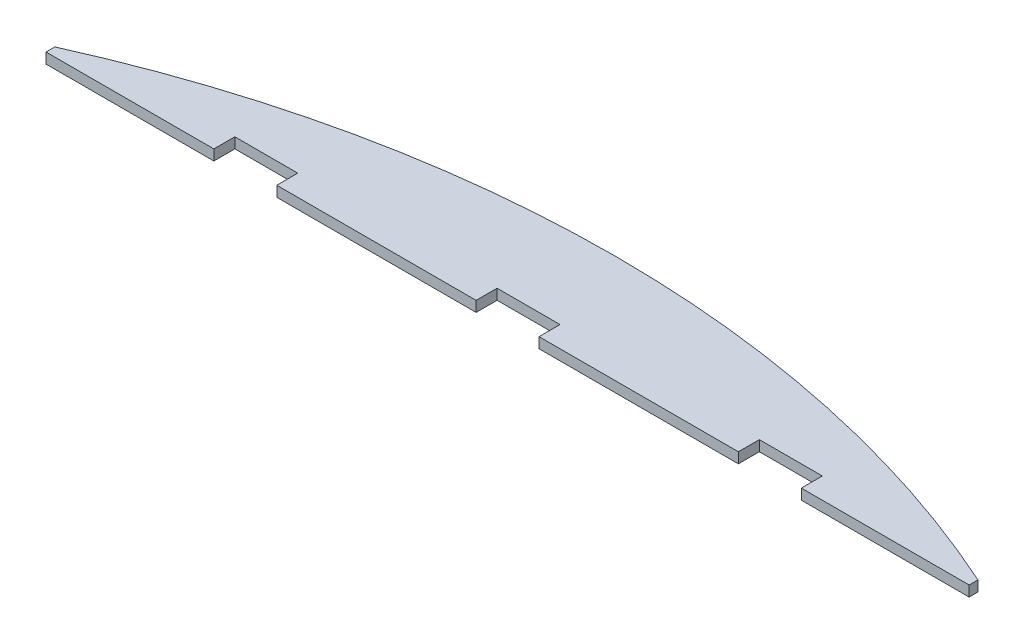
ISO-10303-21;
HEADER;
FILE_DESCRIPTION(('STEP AP214'),'2;1');
FILE_NAME('part.step','',(''),(''),'','','');
FILE_SCHEMA(('AUTOMOTIVE_DESIGN { 1 0 10303 214 1 1 1 1 }'));
ENDSEC;
DATA;
#1=APPLICATION_CONTEXT('core data for automotive mechanical design processes');
#2=APPLICATION_PROTOCOL_DEFINITION('international standard','automotive_design',2000,#1);
#3=PRODUCT_CONTEXT('',#1,'mechanical');
#4=PRODUCT('Part','Part','',(#3));
#5=PRODUCT_RELATED_PRODUCT_CATEGORY('part','',(#4));
#6=PRODUCT_DEFINITION_FORMATION('','',#4);
#7=PRODUCT_DEFINITION_CONTEXT('part definition',#1,'design');
#8=PRODUCT_DEFINITION('design','',#6,#7);
#9=PRODUCT_DEFINITION_SHAPE('','',#8);
#10=(LENGTH_UNIT() NAMED_UNIT(*) SI_UNIT(.MILLI.,.METRE.));
#11=(NAMED_UNIT(*) PLANE_ANGLE_UNIT() SI_UNIT($,.RADIAN.));
#12=(NAMED_UNIT(*) SI_UNIT($,.STERADIAN.) SOLID_ANGLE_UNIT());
#13=UNCERTAINTY_MEASURE_WITH_UNIT(LENGTH_MEASURE(1.E-05),#10,'distance_accuracy_value','');
#14=(GEOMETRIC_REPRESENTATION_CONTEXT(3) GLOBAL_UNCERTAINTY_ASSIGNED_CONTEXT((#13)) GLOBAL_UNIT_ASSIGNED_CONTEXT((#10,
#11,#12)) REPRESENTATION_CONTEXT('',''));
#15=CARTESIAN_POINT('',(0.,0.,0.));
#16=DIRECTION('',(0.,0.,1.));
#17=DIRECTION('',(1.,0.,0.));
#18=AXIS2_PLACEMENT_3D('',#15,#16,#17);
#19=CARTESIAN_POINT('',(-30.,1.,3.));
#20=DIRECTION('',(0.,0.,-1.));
#21=DIRECTION('',(-1.,0.,0.));
#22=AXIS2_PLACEMENT_3D('',#19,#20,#21);
#23=PLANE('',#22);
#24=DIRECTION('',(1.,0.,0.));
#25=VECTOR('',#24,1.);
#26=CARTESIAN_POINT('',(-30.,0.,3.));
#27=LINE('',#26,#25);
#28=CARTESIAN_POINT('',(3.,0.,3.));
#29=VERTEX_POINT('',#28);
#30=CARTESIAN_POINT('',(22.,0.,3.));
#31=VERTEX_POINT('',#30);
#32=EDGE_CURVE('E293',#29,#31,#27,.T.);
#33=ORIENTED_EDGE('',*,*,#32,.T.);
#34=DIRECTION('',(0.,1.,0.));
#35=VECTOR('',#34,1.);
#36=CARTESIAN_POINT('',(22.,1.,3.));
#37=LINE('',#36,#35);
#38=CARTESIAN_POINT('',(22.,1.,3.));
#39=VERTEX_POINT('',#38);
#40=EDGE_CURVE('E231',#31,#39,#37,.T.);
#41=ORIENTED_EDGE('',*,*,#40,.T.);
#42=DIRECTION('',(1.,0.,0.));
#43=VECTOR('',#42,1.);
#44=CARTESIAN_POINT('',(30.,1.,3.));
#45=LINE('',#44,#43);
#46=CARTESIAN_POINT('',(3.,1.,3.));
#47=VERTEX_POINT('',#46);
#48=EDGE_CURVE('E500',#47,#39,#45,.T.);
#49=ORIENTED_EDGE('',*,*,#48,.F.);
#50=DIRECTION('',(0.,-1.,0.));
#51=VECTOR('',#50,1.);
#52=CARTESIAN_POINT('',(3.,1.,3.));
#53=LINE('',#52,#51);
#54=EDGE_CURVE('E220',#47,#29,#53,.T.);
#55=ORIENTED_EDGE('',*,*,#54,.T.);
#56=EDGE_LOOP('',(#33,#41,#49,#55));
#57=FACE_BOUND('',#56,.T.);
#58=ADVANCED_FACE('F39',(#57),#23,.F.);
#59=CARTESIAN_POINT('',(-22.,1.,3.));
#60=VERTEX_POINT('',#59);
#61=CARTESIAN_POINT('',(-3.,1.,3.));
#62=VERTEX_POINT('',#61);
#63=EDGE_CURVE('E239',#60,#62,#45,.T.);
#64=ORIENTED_EDGE('',*,*,#63,.F.);
#65=DIRECTION('',(0.,-1.,0.));
#66=VECTOR('',#65,1.);
#67=CARTESIAN_POINT('',(-22.,1.,3.));
#68=LINE('',#67,#66);
#69=CARTESIAN_POINT('',(-22.,0.,3.));
#70=VERTEX_POINT('',#69);
#71=EDGE_CURVE('E226',#60,#70,#68,.T.);
#72=ORIENTED_EDGE('',*,*,#71,.T.);
#73=CARTESIAN_POINT('',(-3.,0.,3.));
#74=VERTEX_POINT('',#73);
#75=EDGE_CURVE('E175',#70,#74,#27,.T.);
#76=ORIENTED_EDGE('',*,*,#75,.T.);
#77=DIRECTION('',(0.,1.,0.));
#78=VECTOR('',#77,1.);
#79=CARTESIAN_POINT('',(-3.,1.,3.));
#80=LINE('',#79,#78);
#81=EDGE_CURVE('E62',#74,#62,#80,.T.);
#82=ORIENTED_EDGE('',*,*,#81,.T.);
#83=EDGE_LOOP('',(#64,#72,#76,#82));
#84=FACE_BOUND('',#83,.T.);
#85=ADVANCED_FACE('F299',(#84),#23,.F.);
#86=CARTESIAN_POINT('',(28.,1.,3.));
#87=VERTEX_POINT('',#86);
#88=CARTESIAN_POINT('',(44.,1.,3.));
#89=VERTEX_POINT('',#88);
#90=EDGE_CURVE('E240',#87,#89,#45,.T.);
#91=ORIENTED_EDGE('',*,*,#90,.F.);
#92=DIRECTION('',(0.,-1.,0.));
#93=VECTOR('',#92,1.);
#94=CARTESIAN_POINT('',(28.,1.,3.));
#95=LINE('',#94,#93);
#96=CARTESIAN_POINT('',(28.,0.,3.));
#97=VERTEX_POINT('',#96);
#98=EDGE_CURVE('E228',#87,#97,#95,.T.);
#99=ORIENTED_EDGE('',*,*,#98,.T.);
#100=CARTESIAN_POINT('',(44.,0.,3.));
#101=VERTEX_POINT('',#100);
#102=EDGE_CURVE('E254',#97,#101,#27,.T.);
#103=ORIENTED_EDGE('',*,*,#102,.T.);
#104=DIRECTION('',(0.,-1.,0.));
#105=VECTOR('',#104,1.);
#106=CARTESIAN_POINT('',(44.,1.,3.));
#107=LINE('',#106,#105);
#108=EDGE_CURVE('E266',#89,#101,#107,.T.);
#109=ORIENTED_EDGE('',*,*,#108,.F.);
#110=EDGE_LOOP('',(#91,#99,#103,#109));
#111=FACE_BOUND('',#110,.T.);
#112=ADVANCED_FACE('F291',(#111),#23,.F.);
#113=CARTESIAN_POINT('',(44.,1.,2.15829110241379));
#114=DIRECTION('',(-1.,0.,0.));
#115=DIRECTION('',(0.,0.,1.));
#116=AXIS2_PLACEMENT_3D('',#113,#114,#115);
#117=PLANE('',#116);
#118=DIRECTION('',(0.,0.,-1.));
#119=VECTOR('',#118,1.);
#120=CARTESIAN_POINT('',(44.,0.,2.15829110241379));
#121=LINE('',#120,#119);
#122=CARTESIAN_POINT('',(44.,0.,2.15829110241379));
#123=VERTEX_POINT('',#122);
#124=EDGE_CURVE('E234',#101,#123,#121,.T.);
#125=ORIENTED_EDGE('',*,*,#124,.T.);
#126=DIRECTION('',(0.,-1.,0.));
#127=VECTOR('',#126,1.);
#128=CARTESIAN_POINT('',(44.,1.,2.15829110241379));
#129=LINE('',#128,#127);
#130=CARTESIAN_POINT('',(44.,1.,2.15829110241379));
#131=VERTEX_POINT('',#130);
#132=EDGE_CURVE('E263',#131,#123,#129,.T.);
#133=ORIENTED_EDGE('',*,*,#132,.F.);
#134=DIRECTION('',(0.,0.,-1.));
#135=VECTOR('',#134,1.);
#136=CARTESIAN_POINT('',(44.,1.,2.15829110241379));
#137=LINE('',#136,#135);
#138=EDGE_CURVE('E238',#89,#131,#137,.T.);
#139=ORIENTED_EDGE('',*,*,#138,.F.);
#140=ORIENTED_EDGE('',*,*,#108,.T.);
#141=EDGE_LOOP('',(#125,#133,#139,#140));
#142=FACE_BOUND('',#141,.T.);
#143=ADVANCED_FACE('F41',(#142),#117,.F.);
#144=CARTESIAN_POINT('',(0.,1.,100.));
#145=DIRECTION('',(0.,-1.,0.));
#146=DIRECTION('',(0.,0.,-1.));
#147=AXIS2_PLACEMENT_3D('',#144,#145,#146);
#148=CYLINDRICAL_SURFACE('',#147,107.280007457121);
#149=CARTESIAN_POINT('',(0.,0.,100.));
#150=DIRECTION('',(0.,1.,0.));
#151=DIRECTION('',(0.,0.,1.));
#152=AXIS2_PLACEMENT_3D('',#149,#150,#151);
#153=CIRCLE('',#152,107.280007457121);
#154=CARTESIAN_POINT('',(-44.,0.,2.15829110241379));
#155=VERTEX_POINT('',#154);
#156=EDGE_CURVE('E249',#123,#155,#153,.T.);
#157=ORIENTED_EDGE('',*,*,#156,.T.);
#158=DIRECTION('',(0.,-1.,0.));
#159=VECTOR('',#158,1.);
#160=CARTESIAN_POINT('',(-44.,1.,2.15829110241379));
#161=LINE('',#160,#159);
#162=CARTESIAN_POINT('',(-44.,1.,2.15829110241379));
#163=VERTEX_POINT('',#162);
#164=EDGE_CURVE('E260',#163,#155,#161,.T.);
#165=ORIENTED_EDGE('',*,*,#164,.F.);
#166=CARTESIAN_POINT('',(0.,1.,100.));
#167=DIRECTION('',(0.,1.,0.));
#168=DIRECTION('',(0.,0.,1.));
#169=AXIS2_PLACEMENT_3D('',#166,#167,#168);
#170=CIRCLE('',#169,107.280007457121);
#171=EDGE_CURVE('E242',#131,#163,#170,.T.);
#172=ORIENTED_EDGE('',*,*,#171,.F.);
#173=ORIENTED_EDGE('',*,*,#132,.T.);
#174=EDGE_LOOP('',(#157,#165,#172,#173));
#175=FACE_BOUND('',#174,.T.);
#176=ADVANCED_FACE('F283',(#175),#148,.T.);
#177=CARTESIAN_POINT('',(-44.,1.,2.15829110241379));
#178=DIRECTION('',(1.,0.,0.));
#179=DIRECTION('',(0.,0.,-1.));
#180=AXIS2_PLACEMENT_3D('',#177,#178,#179);
#181=PLANE('',#180);
#182=DIRECTION('',(0.,0.,1.));
#183=VECTOR('',#182,1.);
#184=CARTESIAN_POINT('',(-44.,0.,2.15829110241379));
#185=LINE('',#184,#183);
#186=CARTESIAN_POINT('',(-44.,0.,3.));
#187=VERTEX_POINT('',#186);
#188=EDGE_CURVE('E251',#155,#187,#185,.T.);
#189=ORIENTED_EDGE('',*,*,#188,.T.);
#190=DIRECTION('',(0.,-1.,0.));
#191=VECTOR('',#190,1.);
#192=CARTESIAN_POINT('',(-44.,1.,3.));
#193=LINE('',#192,#191);
#194=CARTESIAN_POINT('',(-44.,1.,3.));
#195=VERTEX_POINT('',#194);
#196=EDGE_CURVE('E247',#195,#187,#193,.T.);
#197=ORIENTED_EDGE('',*,*,#196,.F.);
#198=DIRECTION('',(0.,0.,1.));
#199=VECTOR('',#198,1.);
#200=CARTESIAN_POINT('',(-44.,1.,2.15829110241379));
#201=LINE('',#200,#199);
#202=EDGE_CURVE('E244',#163,#195,#201,.T.);
#203=ORIENTED_EDGE('',*,*,#202,.F.);
#204=ORIENTED_EDGE('',*,*,#164,.T.);
#205=EDGE_LOOP('',(#189,#197,#203,#204));
#206=FACE_BOUND('',#205,.T.);
#207=ADVANCED_FACE('F277',(#206),#181,.F.);
#208=CARTESIAN_POINT('',(-28.,0.,3.));
#209=VERTEX_POINT('',#208);
#210=EDGE_CURVE('E255',#187,#209,#27,.T.);
#211=ORIENTED_EDGE('',*,*,#210,.T.);
#212=DIRECTION('',(0.,1.,0.));
#213=VECTOR('',#212,1.);
#214=CARTESIAN_POINT('',(-28.,1.,3.));
#215=LINE('',#214,#213);
#216=CARTESIAN_POINT('',(-28.,1.,3.));
#217=VERTEX_POINT('',#216);
#218=EDGE_CURVE('E223',#209,#217,#215,.T.);
#219=ORIENTED_EDGE('',*,*,#218,.T.);
#220=EDGE_CURVE('E235',#195,#217,#45,.T.);
#221=ORIENTED_EDGE('',*,*,#220,.F.);
#222=ORIENTED_EDGE('',*,*,#196,.T.);
#223=EDGE_LOOP('',(#211,#219,#221,#222));
#224=FACE_BOUND('',#223,.T.);
#225=ADVANCED_FACE('F273',(#224),#23,.F.);
#226=CARTESIAN_POINT('',(0.,1.,100.));
#227=DIRECTION('',(0.,1.,0.));
#228=DIRECTION('',(0.,0.,1.));
#229=AXIS2_PLACEMENT_3D('',#226,#227,#228);
#230=PLANE('',#229);
#231=DIRECTION('',(0.,0.,-1.));
#232=VECTOR('',#231,1.);
#233=CARTESIAN_POINT('',(22.,1.,5.00000000000001));
#234=LINE('',#233,#232);
#235=CARTESIAN_POINT('',(22.,1.,1.00000000000001));
#236=VERTEX_POINT('',#235);
#237=EDGE_CURVE('E189',#39,#236,#234,.T.);
#238=ORIENTED_EDGE('',*,*,#237,.T.);
#239=DIRECTION('',(1.,0.,0.));
#240=VECTOR('',#239,1.);
#241=CARTESIAN_POINT('',(22.,1.,1.00000000000001));
#242=LINE('',#241,#240);
#243=CARTESIAN_POINT('',(28.,1.,1.00000000000001));
#244=VERTEX_POINT('',#243);
#245=EDGE_CURVE('E194',#236,#244,#242,.T.);
#246=ORIENTED_EDGE('',*,*,#245,.T.);
#247=DIRECTION('',(0.,0.,1.));
#248=VECTOR('',#247,1.);
#249=CARTESIAN_POINT('',(28.,1.,5.00000000000001));
#250=LINE('',#249,#248);
#251=EDGE_CURVE('E198',#244,#87,#250,.T.);
#252=ORIENTED_EDGE('',*,*,#251,.T.);
#253=ORIENTED_EDGE('',*,*,#90,.T.);
#254=ORIENTED_EDGE('',*,*,#138,.T.);
#255=ORIENTED_EDGE('',*,*,#171,.T.);
#256=ORIENTED_EDGE('',*,*,#202,.T.);
#257=ORIENTED_EDGE('',*,*,#220,.T.);
#258=DIRECTION('',(0.,0.,-1.));
#259=VECTOR('',#258,1.);
#260=CARTESIAN_POINT('',(-28.,1.,4.99999999999983));
#261=LINE('',#260,#259);
#262=CARTESIAN_POINT('',(-28.,1.,0.999999999999831));
#263=VERTEX_POINT('',#262);
#264=EDGE_CURVE('E183',#217,#263,#261,.T.);
#265=ORIENTED_EDGE('',*,*,#264,.T.);
#266=DIRECTION('',(1.,0.,0.));
#267=VECTOR('',#266,1.);
#268=CARTESIAN_POINT('',(-28.,1.,0.999999999999831));
#269=LINE('',#268,#267);
#270=CARTESIAN_POINT('',(-22.,1.,0.999999999999831));
#271=VERTEX_POINT('',#270);
#272=EDGE_CURVE('E181',#263,#271,#269,.T.);
#273=ORIENTED_EDGE('',*,*,#272,.T.);
#274=DIRECTION('',(0.,0.,1.));
#275=VECTOR('',#274,1.);
#276=CARTESIAN_POINT('',(-22.,1.,4.99999999999983));
#277=LINE('',#276,#275);
#278=EDGE_CURVE('E159',#271,#60,#277,.T.);
#279=ORIENTED_EDGE('',*,*,#278,.T.);
#280=ORIENTED_EDGE('',*,*,#63,.T.);
#281=DIRECTION('',(0.,0.,-1.));
#282=VECTOR('',#281,1.);
#283=CARTESIAN_POINT('',(-3.,1.,5.00000000000001));
#284=LINE('',#283,#282);
#285=CARTESIAN_POINT('',(-3.,1.,1.00000000000001));
#286=VERTEX_POINT('',#285);
#287=EDGE_CURVE('E206',#62,#286,#284,.T.);
#288=ORIENTED_EDGE('',*,*,#287,.T.);
#289=DIRECTION('',(1.,0.,0.));
#290=VECTOR('',#289,1.);
#291=CARTESIAN_POINT('',(-3.,1.,1.00000000000001));
#292=LINE('',#291,#290);
#293=CARTESIAN_POINT('',(3.,1.,1.00000000000001));
#294=VERTEX_POINT('',#293);
#295=EDGE_CURVE('E209',#286,#294,#292,.T.);
#296=ORIENTED_EDGE('',*,*,#295,.T.);
#297=DIRECTION('',(0.,0.,1.));
#298=VECTOR('',#297,1.);
#299=CARTESIAN_POINT('',(3.,1.,5.00000000000001));
#300=LINE('',#299,#298);
#301=EDGE_CURVE('E203',#294,#47,#300,.T.);
#302=ORIENTED_EDGE('',*,*,#301,.T.);
#303=ORIENTED_EDGE('',*,*,#48,.T.);
#304=EDGE_LOOP('',(#238,#246,#252,#253,#254,#255,#256,#257,#265,#273,#279,#280,#288,#296,#302,#303));
#305=FACE_BOUND('',#304,.T.);
#306=ADVANCED_FACE('F302',(#305),#230,.T.);
#307=CARTESIAN_POINT('',(0.,0.,100.));
#308=DIRECTION('',(0.,1.,0.));
#309=DIRECTION('',(0.,0.,1.));
#310=AXIS2_PLACEMENT_3D('',#307,#308,#309);
#311=PLANE('',#310);
#312=DIRECTION('',(1.,0.,0.));
#313=VECTOR('',#312,1.);
#314=CARTESIAN_POINT('',(22.,0.,1.00000000000001));
#315=LINE('',#314,#313);
#316=CARTESIAN_POINT('',(22.,0.,1.00000000000001));
#317=VERTEX_POINT('',#316);
#318=CARTESIAN_POINT('',(28.,0.,1.));
#319=VERTEX_POINT('',#318);
#320=EDGE_CURVE('E54',#317,#319,#315,.T.);
#321=ORIENTED_EDGE('',*,*,#320,.F.);
#322=DIRECTION('',(0.,0.,1.));
#323=VECTOR('',#322,1.);
#324=CARTESIAN_POINT('',(22.,0.,100.));
#325=LINE('',#324,#323);
#326=EDGE_CURVE('E11',#317,#31,#325,.T.);
#327=ORIENTED_EDGE('',*,*,#326,.T.);
#328=ORIENTED_EDGE('',*,*,#32,.F.);
#329=DIRECTION('',(0.,0.,1.));
#330=VECTOR('',#329,1.);
#331=CARTESIAN_POINT('',(3.,0.,5.00000000000001));
#332=LINE('',#331,#330);
#333=CARTESIAN_POINT('',(3.,0.,1.00000000000001));
#334=VERTEX_POINT('',#333);
#335=EDGE_CURVE('E176',#334,#29,#332,.T.);
#336=ORIENTED_EDGE('',*,*,#335,.F.);
#337=DIRECTION('',(1.,0.,0.));
#338=VECTOR('',#337,1.);
#339=CARTESIAN_POINT('',(-3.,0.,1.00000000000001));
#340=LINE('',#339,#338);
#341=CARTESIAN_POINT('',(-3.,0.,1.00000000000001));
#342=VERTEX_POINT('',#341);
#343=EDGE_CURVE('E178',#342,#334,#340,.T.);
#344=ORIENTED_EDGE('',*,*,#343,.F.);
#345=DIRECTION('',(0.,0.,1.));
#346=VECTOR('',#345,1.);
#347=CARTESIAN_POINT('',(-3.00000000000001,0.,100.));
#348=LINE('',#347,#346);
#349=EDGE_CURVE('E269',#342,#74,#348,.T.);
#350=ORIENTED_EDGE('',*,*,#349,.T.);
#351=ORIENTED_EDGE('',*,*,#75,.F.);
#352=DIRECTION('',(0.,0.,1.));
#353=VECTOR('',#352,1.);
#354=CARTESIAN_POINT('',(-22.,0.,4.99999999999983));
#355=LINE('',#354,#353);
#356=CARTESIAN_POINT('',(-22.,0.,0.999999999999831));
#357=VERTEX_POINT('',#356);
#358=EDGE_CURVE('E156',#357,#70,#355,.T.);
#359=ORIENTED_EDGE('',*,*,#358,.F.);
#360=DIRECTION('',(1.,0.,0.));
#361=VECTOR('',#360,1.);
#362=CARTESIAN_POINT('',(-28.,0.,0.999999999999831));
#363=LINE('',#362,#361);
#364=CARTESIAN_POINT('',(-28.,0.,0.999999999999831));
#365=VERTEX_POINT('',#364);
#366=EDGE_CURVE('E167',#365,#357,#363,.T.);
#367=ORIENTED_EDGE('',*,*,#366,.F.);
#368=DIRECTION('',(0.,0.,1.));
#369=VECTOR('',#368,1.);
#370=CARTESIAN_POINT('',(-28.,0.,100.));
#371=LINE('',#370,#369);
#372=EDGE_CURVE('E47',#365,#209,#371,.T.);
#373=ORIENTED_EDGE('',*,*,#372,.T.);
#374=ORIENTED_EDGE('',*,*,#210,.F.);
#375=ORIENTED_EDGE('',*,*,#188,.F.);
#376=ORIENTED_EDGE('',*,*,#156,.F.);
#377=ORIENTED_EDGE('',*,*,#124,.F.);
#378=ORIENTED_EDGE('',*,*,#102,.F.);
#379=DIRECTION('',(0.,0.,1.));
#380=VECTOR('',#379,1.);
#381=CARTESIAN_POINT('',(28.,0.,5.00000000000001));
#382=LINE('',#381,#380);
#383=EDGE_CURVE('E192',#319,#97,#382,.T.);
#384=ORIENTED_EDGE('',*,*,#383,.F.);
#385=EDGE_LOOP('',(#321,#327,#328,#336,#344,#350,#351,#359,#367,#373,#374,#375,#376,#377,#378,#384));
#386=FACE_BOUND('',#385,.T.);
#387=ADVANCED_FACE('F173',(#386),#311,.F.);
#388=CARTESIAN_POINT('',(3.,1.,5.00000000000001));
#389=DIRECTION('',(1.,0.,0.));
#390=DIRECTION('',(0.,0.,-1.));
#391=AXIS2_PLACEMENT_3D('',#388,#389,#390);
#392=PLANE('',#391);
#393=ORIENTED_EDGE('',*,*,#301,.F.);
#394=DIRECTION('',(0.,-1.,0.));
#395=VECTOR('',#394,1.);
#396=CARTESIAN_POINT('',(3.,1.,1.00000000000001));
#397=LINE('',#396,#395);
#398=EDGE_CURVE('E215',#294,#334,#397,.T.);
#399=ORIENTED_EDGE('',*,*,#398,.T.);
#400=ORIENTED_EDGE('',*,*,#335,.T.);
#401=ORIENTED_EDGE('',*,*,#54,.F.);
#402=EDGE_LOOP('',(#393,#399,#400,#401));
#403=FACE_BOUND('',#402,.T.);
#404=ADVANCED_FACE('F382',(#403),#392,.F.);
#405=CARTESIAN_POINT('',(-3.,1.,5.00000000000001));
#406=DIRECTION('',(-1.,0.,0.));
#407=DIRECTION('',(0.,0.,1.));
#408=AXIS2_PLACEMENT_3D('',#405,#406,#407);
#409=PLANE('',#408);
#410=ORIENTED_EDGE('',*,*,#349,.F.);
#411=DIRECTION('',(0.,-1.,0.));
#412=VECTOR('',#411,1.);
#413=CARTESIAN_POINT('',(-3.,1.,1.00000000000001));
#414=LINE('',#413,#412);
#415=EDGE_CURVE('E211',#286,#342,#414,.T.);
#416=ORIENTED_EDGE('',*,*,#415,.F.);
#417=ORIENTED_EDGE('',*,*,#287,.F.);
#418=ORIENTED_EDGE('',*,*,#81,.F.);
#419=EDGE_LOOP('',(#410,#416,#417,#418));
#420=FACE_BOUND('',#419,.T.);
#421=ADVANCED_FACE('F390',(#420),#409,.F.);
#422=CARTESIAN_POINT('',(-3.,1.,1.00000000000001));
#423=DIRECTION('',(0.,0.,-1.));
#424=DIRECTION('',(-1.,0.,0.));
#425=AXIS2_PLACEMENT_3D('',#422,#423,#424);
#426=PLANE('',#425);
#427=ORIENTED_EDGE('',*,*,#343,.T.);
#428=ORIENTED_EDGE('',*,*,#398,.F.);
#429=ORIENTED_EDGE('',*,*,#295,.F.);
#430=ORIENTED_EDGE('',*,*,#415,.T.);
#431=EDGE_LOOP('',(#427,#428,#429,#430));
#432=FACE_BOUND('',#431,.T.);
#433=ADVANCED_FACE('F313',(#432),#426,.F.);
#434=CARTESIAN_POINT('',(-22.,1.,4.99999999999983));
#435=DIRECTION('',(1.,0.,0.));
#436=DIRECTION('',(0.,0.,-1.));
#437=AXIS2_PLACEMENT_3D('',#434,#435,#436);
#438=PLANE('',#437);
#439=ORIENTED_EDGE('',*,*,#278,.F.);
#440=DIRECTION('',(0.,-1.,0.));
#441=VECTOR('',#440,1.);
#442=CARTESIAN_POINT('',(-22.,1.,0.999999999999831));
#443=LINE('',#442,#441);
#444=EDGE_CURVE('E152',#271,#357,#443,.T.);
#445=ORIENTED_EDGE('',*,*,#444,.T.);
#446=ORIENTED_EDGE('',*,*,#358,.T.);
#447=ORIENTED_EDGE('',*,*,#71,.F.);
#448=EDGE_LOOP('',(#439,#445,#446,#447));
#449=FACE_BOUND('',#448,.T.);
#450=ADVANCED_FACE('F154',(#449),#438,.F.);
#451=CARTESIAN_POINT('',(-28.,1.,4.99999999999983));
#452=DIRECTION('',(-1.,0.,0.));
#453=DIRECTION('',(0.,0.,1.));
#454=AXIS2_PLACEMENT_3D('',#451,#452,#453);
#455=PLANE('',#454);
#456=ORIENTED_EDGE('',*,*,#372,.F.);
#457=DIRECTION('',(0.,-1.,0.));
#458=VECTOR('',#457,1.);
#459=CARTESIAN_POINT('',(-28.,1.,0.999999999999831));
#460=LINE('',#459,#458);
#461=EDGE_CURVE('E163',#263,#365,#460,.T.);
#462=ORIENTED_EDGE('',*,*,#461,.F.);
#463=ORIENTED_EDGE('',*,*,#264,.F.);
#464=ORIENTED_EDGE('',*,*,#218,.F.);
#465=EDGE_LOOP('',(#456,#462,#463,#464));
#466=FACE_BOUND('',#465,.T.);
#467=ADVANCED_FACE('F303',(#466),#455,.F.);
#468=CARTESIAN_POINT('',(-28.,1.,0.999999999999831));
#469=DIRECTION('',(0.,0.,-1.));
#470=DIRECTION('',(-1.,0.,0.));
#471=AXIS2_PLACEMENT_3D('',#468,#469,#470);
#472=PLANE('',#471);
#473=ORIENTED_EDGE('',*,*,#366,.T.);
#474=ORIENTED_EDGE('',*,*,#444,.F.);
#475=ORIENTED_EDGE('',*,*,#272,.F.);
#476=ORIENTED_EDGE('',*,*,#461,.T.);
#477=EDGE_LOOP('',(#473,#474,#475,#476));
#478=FACE_BOUND('',#477,.T.);
#479=ADVANCED_FACE('F168',(#478),#472,.F.);
#480=CARTESIAN_POINT('',(22.,1.,5.00000000000001));
#481=DIRECTION('',(-1.,0.,0.));
#482=DIRECTION('',(0.,0.,1.));
#483=AXIS2_PLACEMENT_3D('',#480,#481,#482);
#484=PLANE('',#483);
#485=ORIENTED_EDGE('',*,*,#326,.F.);
#486=DIRECTION('',(0.,-1.,0.));
#487=VECTOR('',#486,1.);
#488=CARTESIAN_POINT('',(22.,1.,1.00000000000001));
#489=LINE('',#488,#487);
#490=EDGE_CURVE('E190',#236,#317,#489,.T.);
#491=ORIENTED_EDGE('',*,*,#490,.F.);
#492=ORIENTED_EDGE('',*,*,#237,.F.);
#493=ORIENTED_EDGE('',*,*,#40,.F.);
#494=EDGE_LOOP('',(#485,#491,#492,#493));
#495=FACE_BOUND('',#494,.T.);
#496=ADVANCED_FACE('F311',(#495),#484,.F.);
#497=CARTESIAN_POINT('',(28.,1.,5.00000000000001));
#498=DIRECTION('',(1.,0.,0.));
#499=DIRECTION('',(0.,0.,-1.));
#500=AXIS2_PLACEMENT_3D('',#497,#498,#499);
#501=PLANE('',#500);
#502=ORIENTED_EDGE('',*,*,#251,.F.);
#503=DIRECTION('',(0.,-1.,0.));
#504=VECTOR('',#503,1.);
#505=CARTESIAN_POINT('',(28.,1.,1.00000000000001));
#506=LINE('',#505,#504);
#507=EDGE_CURVE('E187',#244,#319,#506,.T.);
#508=ORIENTED_EDGE('',*,*,#507,.T.);
#509=ORIENTED_EDGE('',*,*,#383,.T.);
#510=ORIENTED_EDGE('',*,*,#98,.F.);
#511=EDGE_LOOP('',(#502,#508,#509,#510));
#512=FACE_BOUND('',#511,.T.);
#513=ADVANCED_FACE('F439',(#512),#501,.F.);
#514=CARTESIAN_POINT('',(22.,1.,1.00000000000001));
#515=DIRECTION('',(0.,0.,-1.));
#516=DIRECTION('',(-1.,0.,0.));
#517=AXIS2_PLACEMENT_3D('',#514,#515,#516);
#518=PLANE('',#517);
#519=ORIENTED_EDGE('',*,*,#320,.T.);
#520=ORIENTED_EDGE('',*,*,#507,.F.);
#521=ORIENTED_EDGE('',*,*,#245,.F.);
#522=ORIENTED_EDGE('',*,*,#490,.T.);
#523=EDGE_LOOP('',(#519,#520,#521,#522));
#524=FACE_BOUND('',#523,.T.);
#525=ADVANCED_FACE('F450',(#524),#518,.F.);
#526=CLOSED_SHELL('',(#58,#85,#112,#143,#176,#207,#225,#306,#387,#404,#421,#433,#450,#467,#479,
#496,#513,#525));
#527=MANIFOLD_SOLID_BREP('B2',#526);
#528=ADVANCED_BREP_SHAPE_REPRESENTATION('',(#18,#527),#14);
#529=SHAPE_DEFINITION_REPRESENTATION(#9,#528);
ENDSEC;
END-ISO-10303-21;
